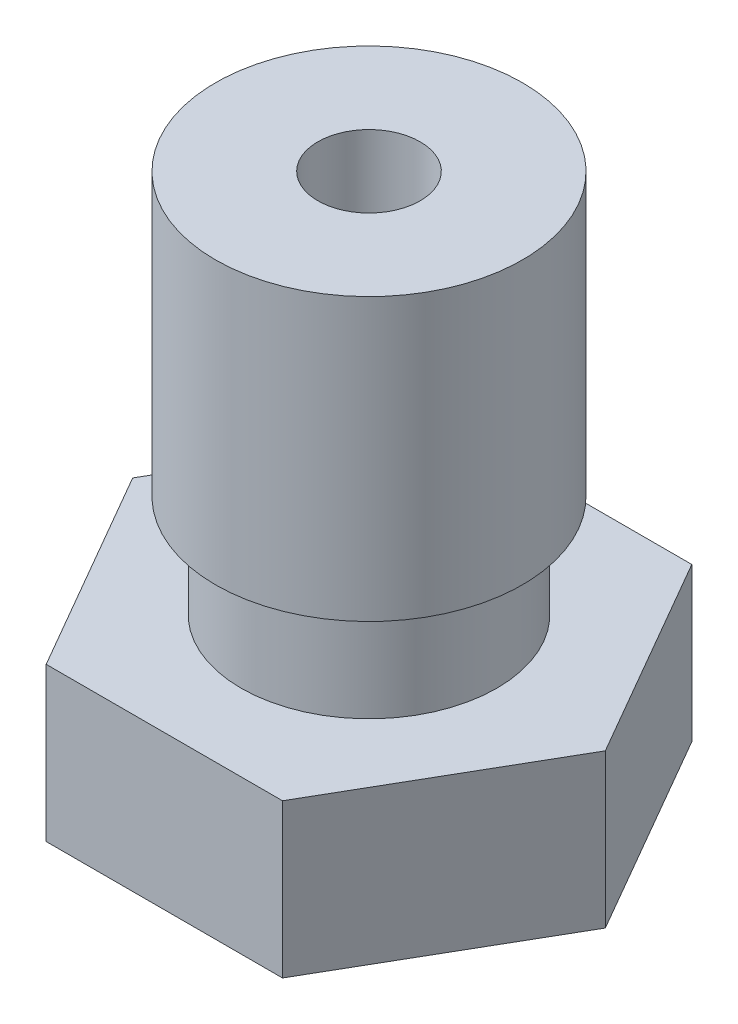
ISO-10303-21;
HEADER;
FILE_DESCRIPTION(('STEP AP214'),'2;1');
FILE_NAME('part.step','',(''),(''),'','','');
FILE_SCHEMA(('AUTOMOTIVE_DESIGN { 1 0 10303 214 1 1 1 1 }'));
ENDSEC;
DATA;
#1=APPLICATION_CONTEXT('core data for automotive mechanical design processes');
#2=APPLICATION_PROTOCOL_DEFINITION('international standard','automotive_design',2000,#1);
#3=PRODUCT_CONTEXT('',#1,'mechanical');
#4=PRODUCT('Part','Part','',(#3));
#5=PRODUCT_RELATED_PRODUCT_CATEGORY('part','',(#4));
#6=PRODUCT_DEFINITION_FORMATION('','',#4);
#7=PRODUCT_DEFINITION_CONTEXT('part definition',#1,'design');
#8=PRODUCT_DEFINITION('design','',#6,#7);
#9=PRODUCT_DEFINITION_SHAPE('','',#8);
#10=(LENGTH_UNIT() NAMED_UNIT(*) SI_UNIT(.MILLI.,.METRE.));
#11=(NAMED_UNIT(*) PLANE_ANGLE_UNIT() SI_UNIT($,.RADIAN.));
#12=(NAMED_UNIT(*) SI_UNIT($,.STERADIAN.) SOLID_ANGLE_UNIT());
#13=UNCERTAINTY_MEASURE_WITH_UNIT(LENGTH_MEASURE(1.E-05),#10,'distance_accuracy_value','');
#14=(GEOMETRIC_REPRESENTATION_CONTEXT(3) GLOBAL_UNCERTAINTY_ASSIGNED_CONTEXT((#13)) GLOBAL_UNIT_ASSIGNED_CONTEXT((#10,
#11,#12)) REPRESENTATION_CONTEXT('',''));
#15=CARTESIAN_POINT('',(0.,0.,0.));
#16=DIRECTION('',(0.,0.,1.));
#17=DIRECTION('',(1.,0.,0.));
#18=AXIS2_PLACEMENT_3D('',#15,#16,#17);
#19=CARTESIAN_POINT('',(0.,3.,0.));
#20=DIRECTION('',(0.,1.,0.));
#21=DIRECTION('',(0.,0.,1.));
#22=AXIS2_PLACEMENT_3D('',#19,#20,#21);
#23=PLANE('',#22);
#24=DIRECTION('',(-0.5,0.,-0.866025403784439));
#25=VECTOR('',#24,1.);
#26=CARTESIAN_POINT('',(4.61880215351701,3.,0.));
#27=LINE('',#26,#25);
#28=CARTESIAN_POINT('',(4.61880215351701,3.,0.));
#29=VERTEX_POINT('',#28);
#30=CARTESIAN_POINT('',(2.3094010767585,3.,-4.00000000000001));
#31=VERTEX_POINT('',#30);
#32=EDGE_CURVE('E131',#29,#31,#27,.T.);
#33=ORIENTED_EDGE('',*,*,#32,.T.);
#34=DIRECTION('',(-1.,0.,0.));
#35=VECTOR('',#34,1.);
#36=CARTESIAN_POINT('',(2.3094010767585,3.,-4.00000000000001));
#37=LINE('',#36,#35);
#38=CARTESIAN_POINT('',(-2.30940107675849,3.,-4.));
#39=VERTEX_POINT('',#38);
#40=EDGE_CURVE('E89',#31,#39,#37,.T.);
#41=ORIENTED_EDGE('',*,*,#40,.T.);
#42=DIRECTION('',(-0.5,0.,0.866025403784439));
#43=VECTOR('',#42,1.);
#44=CARTESIAN_POINT('',(-2.30940107675849,3.,-4.));
#45=LINE('',#44,#43);
#46=CARTESIAN_POINT('',(-4.618802153517,3.,0.));
#47=VERTEX_POINT('',#46);
#48=EDGE_CURVE('E102',#39,#47,#45,.T.);
#49=ORIENTED_EDGE('',*,*,#48,.T.);
#50=DIRECTION('',(0.5,0.,0.866025403784438));
#51=VECTOR('',#50,1.);
#52=CARTESIAN_POINT('',(-4.618802153517,3.,0.));
#53=LINE('',#52,#51);
#54=CARTESIAN_POINT('',(-2.3094010767585,3.,4.));
#55=VERTEX_POINT('',#54);
#56=EDGE_CURVE('E96',#47,#55,#53,.T.);
#57=ORIENTED_EDGE('',*,*,#56,.T.);
#58=DIRECTION('',(1.,0.,0.));
#59=VECTOR('',#58,1.);
#60=CARTESIAN_POINT('',(-2.3094010767585,3.,4.));
#61=LINE('',#60,#59);
#62=CARTESIAN_POINT('',(2.3094010767585,3.,4.));
#63=VERTEX_POINT('',#62);
#64=EDGE_CURVE('E100',#55,#63,#61,.T.);
#65=ORIENTED_EDGE('',*,*,#64,.T.);
#66=DIRECTION('',(0.5,0.,-0.866025403784439));
#67=VECTOR('',#66,1.);
#68=CARTESIAN_POINT('',(2.3094010767585,3.,4.));
#69=LINE('',#68,#67);
#70=EDGE_CURVE('E52',#63,#29,#69,.T.);
#71=ORIENTED_EDGE('',*,*,#70,.T.);
#72=EDGE_LOOP('',(#33,#41,#49,#57,#65,#71));
#73=FACE_BOUND('',#72,.T.);
#74=CARTESIAN_POINT('',(0.,3.,0.));
#75=DIRECTION('',(0.,-1.,0.));
#76=DIRECTION('',(0.,0.,-1.));
#77=AXIS2_PLACEMENT_3D('',#74,#75,#76);
#78=CIRCLE('',#77,2.5);
#79=CARTESIAN_POINT('',(0.,3.,-2.5));
#80=VERTEX_POINT('',#79);
#81=EDGE_CURVE('E217',#80,#80,#78,.T.);
#82=ORIENTED_EDGE('',*,*,#81,.T.);
#83=EDGE_LOOP('',(#82));
#84=FACE_BOUND('',#83,.T.);
#85=ADVANCED_FACE('F35',(#73,#84),#23,.T.);
#86=CARTESIAN_POINT('',(0.,0.,0.));
#87=DIRECTION('',(0.,1.,0.));
#88=DIRECTION('',(0.,0.,1.));
#89=AXIS2_PLACEMENT_3D('',#86,#87,#88);
#90=PLANE('',#89);
#91=CARTESIAN_POINT('',(0.,0.,0.));
#92=DIRECTION('',(0.,-1.,0.));
#93=DIRECTION('',(0.,0.,-1.));
#94=AXIS2_PLACEMENT_3D('',#91,#92,#93);
#95=CIRCLE('',#94,2.00041507641941);
#96=CARTESIAN_POINT('',(0.,0.,-2.00041507641941));
#97=VERTEX_POINT('',#96);
#98=EDGE_CURVE('E195',#97,#97,#95,.T.);
#99=ORIENTED_EDGE('',*,*,#98,.F.);
#100=EDGE_LOOP('',(#99));
#101=FACE_BOUND('',#100,.T.);
#102=DIRECTION('',(-0.5,0.,-0.866025403784439));
#103=VECTOR('',#102,1.);
#104=CARTESIAN_POINT('',(4.61880215351701,0.,0.));
#105=LINE('',#104,#103);
#106=CARTESIAN_POINT('',(4.61880215351701,0.,0.));
#107=VERTEX_POINT('',#106);
#108=CARTESIAN_POINT('',(2.3094010767585,0.,-4.00000000000001));
#109=VERTEX_POINT('',#108);
#110=EDGE_CURVE('E120',#107,#109,#105,.T.);
#111=ORIENTED_EDGE('',*,*,#110,.F.);
#112=DIRECTION('',(0.5,0.,-0.866025403784439));
#113=VECTOR('',#112,1.);
#114=CARTESIAN_POINT('',(2.3094010767585,0.,4.));
#115=LINE('',#114,#113);
#116=CARTESIAN_POINT('',(2.3094010767585,0.,4.));
#117=VERTEX_POINT('',#116);
#118=EDGE_CURVE('E81',#117,#107,#115,.T.);
#119=ORIENTED_EDGE('',*,*,#118,.F.);
#120=DIRECTION('',(1.,0.,0.));
#121=VECTOR('',#120,1.);
#122=CARTESIAN_POINT('',(-2.3094010767585,0.,4.));
#123=LINE('',#122,#121);
#124=CARTESIAN_POINT('',(-2.3094010767585,0.,4.));
#125=VERTEX_POINT('',#124);
#126=EDGE_CURVE('E75',#125,#117,#123,.T.);
#127=ORIENTED_EDGE('',*,*,#126,.F.);
#128=DIRECTION('',(0.5,0.,0.866025403784438));
#129=VECTOR('',#128,1.);
#130=CARTESIAN_POINT('',(-4.618802153517,0.,0.));
#131=LINE('',#130,#129);
#132=CARTESIAN_POINT('',(-4.618802153517,0.,0.));
#133=VERTEX_POINT('',#132);
#134=EDGE_CURVE('E110',#133,#125,#131,.T.);
#135=ORIENTED_EDGE('',*,*,#134,.F.);
#136=DIRECTION('',(-0.5,0.,0.866025403784439));
#137=VECTOR('',#136,1.);
#138=CARTESIAN_POINT('',(-2.30940107675849,0.,-4.));
#139=LINE('',#138,#137);
#140=CARTESIAN_POINT('',(-2.30940107675849,0.,-4.));
#141=VERTEX_POINT('',#140);
#142=EDGE_CURVE('E126',#141,#133,#139,.T.);
#143=ORIENTED_EDGE('',*,*,#142,.F.);
#144=DIRECTION('',(-1.,0.,0.));
#145=VECTOR('',#144,1.);
#146=CARTESIAN_POINT('',(2.3094010767585,0.,-4.00000000000001));
#147=LINE('',#146,#145);
#148=EDGE_CURVE('E123',#109,#141,#147,.T.);
#149=ORIENTED_EDGE('',*,*,#148,.F.);
#150=EDGE_LOOP('',(#111,#119,#127,#135,#143,#149));
#151=FACE_BOUND('',#150,.T.);
#152=ADVANCED_FACE('F140',(#101,#151),#90,.F.);
#153=CARTESIAN_POINT('',(4.61880215351701,3.,0.));
#154=DIRECTION('',(-0.866025403784439,0.,0.5));
#155=DIRECTION('',(0.5,0.,0.866025403784439));
#156=AXIS2_PLACEMENT_3D('',#153,#154,#155);
#157=PLANE('',#156);
#158=ORIENTED_EDGE('',*,*,#110,.T.);
#159=DIRECTION('',(0.,-1.,0.));
#160=VECTOR('',#159,1.);
#161=CARTESIAN_POINT('',(2.3094010767585,3.,-4.00000000000001));
#162=LINE('',#161,#160);
#163=EDGE_CURVE('E11',#31,#109,#162,.T.);
#164=ORIENTED_EDGE('',*,*,#163,.F.);
#165=ORIENTED_EDGE('',*,*,#32,.F.);
#166=DIRECTION('',(0.,-1.,0.));
#167=VECTOR('',#166,1.);
#168=CARTESIAN_POINT('',(4.61880215351701,3.,0.));
#169=LINE('',#168,#167);
#170=EDGE_CURVE('E116',#29,#107,#169,.T.);
#171=ORIENTED_EDGE('',*,*,#170,.T.);
#172=EDGE_LOOP('',(#158,#164,#165,#171));
#173=FACE_BOUND('',#172,.T.);
#174=ADVANCED_FACE('F37',(#173),#157,.F.);
#175=CARTESIAN_POINT('',(2.3094010767585,3.,-4.00000000000001));
#176=DIRECTION('',(0.,0.,1.));
#177=DIRECTION('',(1.,0.,0.));
#178=AXIS2_PLACEMENT_3D('',#175,#176,#177);
#179=PLANE('',#178);
#180=ORIENTED_EDGE('',*,*,#148,.T.);
#181=DIRECTION('',(0.,-1.,0.));
#182=VECTOR('',#181,1.);
#183=CARTESIAN_POINT('',(-2.30940107675849,3.,-4.));
#184=LINE('',#183,#182);
#185=EDGE_CURVE('E44',#39,#141,#184,.T.);
#186=ORIENTED_EDGE('',*,*,#185,.F.);
#187=ORIENTED_EDGE('',*,*,#40,.F.);
#188=ORIENTED_EDGE('',*,*,#163,.T.);
#189=EDGE_LOOP('',(#180,#186,#187,#188));
#190=FACE_BOUND('',#189,.T.);
#191=ADVANCED_FACE('F305',(#190),#179,.F.);
#192=CARTESIAN_POINT('',(-2.30940107675849,3.,-4.));
#193=DIRECTION('',(0.866025403784439,0.,0.5));
#194=DIRECTION('',(0.5,0.,-0.866025403784439));
#195=AXIS2_PLACEMENT_3D('',#192,#193,#194);
#196=PLANE('',#195);
#197=ORIENTED_EDGE('',*,*,#142,.T.);
#198=DIRECTION('',(0.,-1.,0.));
#199=VECTOR('',#198,1.);
#200=CARTESIAN_POINT('',(-4.618802153517,3.,0.));
#201=LINE('',#200,#199);
#202=EDGE_CURVE('E111',#47,#133,#201,.T.);
#203=ORIENTED_EDGE('',*,*,#202,.F.);
#204=ORIENTED_EDGE('',*,*,#48,.F.);
#205=ORIENTED_EDGE('',*,*,#185,.T.);
#206=EDGE_LOOP('',(#197,#203,#204,#205));
#207=FACE_BOUND('',#206,.T.);
#208=ADVANCED_FACE('F137',(#207),#196,.F.);
#209=CARTESIAN_POINT('',(-4.618802153517,3.,0.));
#210=DIRECTION('',(0.866025403784439,0.,-0.5));
#211=DIRECTION('',(-0.5,0.,-0.866025403784439));
#212=AXIS2_PLACEMENT_3D('',#209,#210,#211);
#213=PLANE('',#212);
#214=ORIENTED_EDGE('',*,*,#134,.T.);
#215=DIRECTION('',(0.,-1.,0.));
#216=VECTOR('',#215,1.);
#217=CARTESIAN_POINT('',(-2.3094010767585,3.,4.));
#218=LINE('',#217,#216);
#219=EDGE_CURVE('E107',#55,#125,#218,.T.);
#220=ORIENTED_EDGE('',*,*,#219,.F.);
#221=ORIENTED_EDGE('',*,*,#56,.F.);
#222=ORIENTED_EDGE('',*,*,#202,.T.);
#223=EDGE_LOOP('',(#214,#220,#221,#222));
#224=FACE_BOUND('',#223,.T.);
#225=ADVANCED_FACE('F108',(#224),#213,.F.);
#226=CARTESIAN_POINT('',(-2.3094010767585,3.,4.));
#227=DIRECTION('',(0.,0.,-1.));
#228=DIRECTION('',(-1.,0.,0.));
#229=AXIS2_PLACEMENT_3D('',#226,#227,#228);
#230=PLANE('',#229);
#231=ORIENTED_EDGE('',*,*,#126,.T.);
#232=DIRECTION('',(0.,-1.,0.));
#233=VECTOR('',#232,1.);
#234=CARTESIAN_POINT('',(2.3094010767585,3.,4.));
#235=LINE('',#234,#233);
#236=EDGE_CURVE('E112',#63,#117,#235,.T.);
#237=ORIENTED_EDGE('',*,*,#236,.F.);
#238=ORIENTED_EDGE('',*,*,#64,.F.);
#239=ORIENTED_EDGE('',*,*,#219,.T.);
#240=EDGE_LOOP('',(#231,#237,#238,#239));
#241=FACE_BOUND('',#240,.T.);
#242=ADVANCED_FACE('F114',(#241),#230,.F.);
#243=CARTESIAN_POINT('',(2.3094010767585,3.,4.));
#244=DIRECTION('',(-0.866025403784439,0.,-0.5));
#245=DIRECTION('',(-0.5,0.,0.866025403784439));
#246=AXIS2_PLACEMENT_3D('',#243,#244,#245);
#247=PLANE('',#246);
#248=ORIENTED_EDGE('',*,*,#118,.T.);
#249=ORIENTED_EDGE('',*,*,#170,.F.);
#250=ORIENTED_EDGE('',*,*,#70,.F.);
#251=ORIENTED_EDGE('',*,*,#236,.T.);
#252=EDGE_LOOP('',(#248,#249,#250,#251));
#253=FACE_BOUND('',#252,.T.);
#254=ADVANCED_FACE('F144',(#253),#247,.F.);
#255=CARTESIAN_POINT('',(0.,3.,0.));
#256=DIRECTION('',(0.,-1.,0.));
#257=DIRECTION('',(0.,0.,-1.));
#258=AXIS2_PLACEMENT_3D('',#255,#256,#257);
#259=CYLINDRICAL_SURFACE('',#258,1.);
#260=CARTESIAN_POINT('',(0.,0.,0.));
#261=DIRECTION('',(0.,1.,0.));
#262=DIRECTION('',(0.,0.,1.));
#263=AXIS2_PLACEMENT_3D('',#260,#261,#262);
#264=CIRCLE('',#263,1.);
#265=CARTESIAN_POINT('',(0.,0.,1.));
#266=VERTEX_POINT('',#265);
#267=EDGE_CURVE('E124',#266,#266,#264,.T.);
#268=ORIENTED_EDGE('',*,*,#267,.F.);
#269=EDGE_LOOP('',(#268));
#270=FACE_BOUND('',#269,.T.);
#271=CARTESIAN_POINT('',(0.,10.5,0.));
#272=DIRECTION('',(0.,-1.,0.));
#273=DIRECTION('',(0.,0.,-1.));
#274=AXIS2_PLACEMENT_3D('',#271,#272,#273);
#275=CIRCLE('',#274,1.);
#276=CARTESIAN_POINT('',(0.,10.5,-1.));
#277=VERTEX_POINT('',#276);
#278=EDGE_CURVE('E202',#277,#277,#275,.T.);
#279=ORIENTED_EDGE('',*,*,#278,.F.);
#280=EDGE_LOOP('',(#279));
#281=FACE_BOUND('',#280,.T.);
#282=ADVANCED_FACE('F146',(#270,#281),#259,.F.);
#283=CARTESIAN_POINT('',(0.,-2.,0.));
#284=DIRECTION('',(0.,-1.,0.));
#285=DIRECTION('',(0.,0.,-1.));
#286=AXIS2_PLACEMENT_3D('',#283,#284,#285);
#287=CYLINDRICAL_SURFACE('',#286,2.5);
#288=ORIENTED_EDGE('',*,*,#81,.F.);
#289=EDGE_LOOP('',(#288));
#290=FACE_BOUND('',#289,.T.);
#291=CARTESIAN_POINT('',(0.,5.,0.));
#292=DIRECTION('',(0.,-1.,0.));
#293=DIRECTION('',(0.,0.,-1.));
#294=AXIS2_PLACEMENT_3D('',#291,#292,#293);
#295=CIRCLE('',#294,2.5);
#296=CARTESIAN_POINT('',(0.,5.,-2.5));
#297=VERTEX_POINT('',#296);
#298=EDGE_CURVE('E214',#297,#297,#295,.T.);
#299=ORIENTED_EDGE('',*,*,#298,.T.);
#300=EDGE_LOOP('',(#299));
#301=FACE_BOUND('',#300,.T.);
#302=ADVANCED_FACE('F152',(#290,#301),#287,.T.);
#303=CARTESIAN_POINT('',(0.,5.,0.));
#304=DIRECTION('',(0.,1.,0.));
#305=DIRECTION('',(0.,0.,1.));
#306=AXIS2_PLACEMENT_3D('',#303,#304,#305);
#307=PLANE('',#306);
#308=ORIENTED_EDGE('',*,*,#298,.F.);
#309=EDGE_LOOP('',(#308));
#310=FACE_BOUND('',#309,.T.);
#311=CARTESIAN_POINT('',(0.,5.,0.));
#312=DIRECTION('',(0.,-1.,0.));
#313=DIRECTION('',(0.,0.,-1.));
#314=AXIS2_PLACEMENT_3D('',#311,#312,#313);
#315=CIRCLE('',#314,3.);
#316=CARTESIAN_POINT('',(0.,5.,-3.));
#317=VERTEX_POINT('',#316);
#318=EDGE_CURVE('E211',#317,#317,#315,.T.);
#319=ORIENTED_EDGE('',*,*,#318,.T.);
#320=EDGE_LOOP('',(#319));
#321=FACE_BOUND('',#320,.T.);
#322=ADVANCED_FACE('F166',(#310,#321),#307,.F.);
#323=CARTESIAN_POINT('',(0.,-2.,0.));
#324=DIRECTION('',(0.,-1.,0.));
#325=DIRECTION('',(0.,0.,-1.));
#326=AXIS2_PLACEMENT_3D('',#323,#324,#325);
#327=CYLINDRICAL_SURFACE('',#326,3.);
#328=ORIENTED_EDGE('',*,*,#318,.F.);
#329=EDGE_LOOP('',(#328));
#330=FACE_BOUND('',#329,.T.);
#331=CARTESIAN_POINT('',(0.,10.5,0.));
#332=DIRECTION('',(0.,-1.,0.));
#333=DIRECTION('',(0.,0.,-1.));
#334=AXIS2_PLACEMENT_3D('',#331,#332,#333);
#335=CIRCLE('',#334,3.);
#336=CARTESIAN_POINT('',(0.,10.5,-3.));
#337=VERTEX_POINT('',#336);
#338=EDGE_CURVE('E208',#337,#337,#335,.T.);
#339=ORIENTED_EDGE('',*,*,#338,.T.);
#340=EDGE_LOOP('',(#339));
#341=FACE_BOUND('',#340,.T.);
#342=ADVANCED_FACE('F170',(#330,#341),#327,.T.);
#343=CARTESIAN_POINT('',(0.,10.5,0.));
#344=DIRECTION('',(0.,-1.,0.));
#345=DIRECTION('',(0.,0.,-1.));
#346=AXIS2_PLACEMENT_3D('',#343,#344,#345);
#347=PLANE('',#346);
#348=ORIENTED_EDGE('',*,*,#338,.F.);
#349=EDGE_LOOP('',(#348));
#350=FACE_BOUND('',#349,.T.);
#351=ORIENTED_EDGE('',*,*,#278,.T.);
#352=EDGE_LOOP('',(#351));
#353=FACE_BOUND('',#352,.T.);
#354=ADVANCED_FACE('F174',(#350,#353),#347,.F.);
#355=CARTESIAN_POINT('',(0.,0.,0.));
#356=DIRECTION('',(0.,1.,0.));
#357=DIRECTION('',(0.,0.,1.));
#358=AXIS2_PLACEMENT_3D('',#355,#356,#357);
#359=CONICAL_SURFACE('',#358,1.,0.369684288795301);
#360=CARTESIAN_POINT('',(0.,-2.,0.));
#361=DIRECTION('',(0.,-1.,0.));
#362=DIRECTION('',(0.,0.,-1.));
#363=AXIS2_PLACEMENT_3D('',#360,#361,#362);
#364=CIRCLE('',#363,0.225);
#365=CARTESIAN_POINT('',(0.,-2.,-0.225));
#366=VERTEX_POINT('',#365);
#367=EDGE_CURVE('E199',#366,#366,#364,.T.);
#368=ORIENTED_EDGE('',*,*,#367,.T.);
#369=EDGE_LOOP('',(#368));
#370=FACE_BOUND('',#369,.T.);
#371=ORIENTED_EDGE('',*,*,#267,.T.);
#372=EDGE_LOOP('',(#371));
#373=FACE_BOUND('',#372,.T.);
#374=ADVANCED_FACE('F178',(#370,#373),#359,.F.);
#375=CARTESIAN_POINT('',(0.,-2.,0.));
#376=DIRECTION('',(0.,-1.,0.));
#377=DIRECTION('',(0.,0.,-1.));
#378=AXIS2_PLACEMENT_3D('',#375,#376,#377);
#379=PLANE('',#378);
#380=CARTESIAN_POINT('',(0.,-2.,0.));
#381=DIRECTION('',(0.,-1.,0.));
#382=DIRECTION('',(0.,0.,-1.));
#383=AXIS2_PLACEMENT_3D('',#380,#381,#382);
#384=CIRCLE('',#383,0.6);
#385=CARTESIAN_POINT('',(0.,-2.,-0.6));
#386=VERTEX_POINT('',#385);
#387=EDGE_CURVE('E198',#386,#386,#384,.T.);
#388=ORIENTED_EDGE('',*,*,#387,.T.);
#389=EDGE_LOOP('',(#388));
#390=FACE_BOUND('',#389,.T.);
#391=ORIENTED_EDGE('',*,*,#367,.F.);
#392=EDGE_LOOP('',(#391));
#393=FACE_BOUND('',#392,.T.);
#394=ADVANCED_FACE('F182',(#390,#393),#379,.T.);
#395=CARTESIAN_POINT('',(0.,-2.,0.));
#396=DIRECTION('',(0.,1.,0.));
#397=DIRECTION('',(0.,0.,1.));
#398=AXIS2_PLACEMENT_3D('',#395,#396,#397);
#399=CONICAL_SURFACE('',#398,0.6,0.610865238198013);
#400=ORIENTED_EDGE('',*,*,#98,.T.);
#401=EDGE_LOOP('',(#400));
#402=FACE_BOUND('',#401,.T.);
#403=ORIENTED_EDGE('',*,*,#387,.F.);
#404=EDGE_LOOP('',(#403));
#405=FACE_BOUND('',#404,.T.);
#406=ADVANCED_FACE('F186',(#402,#405),#399,.T.);
#407=CLOSED_SHELL('',(#85,#152,#174,#191,#208,#225,#242,#254,#282,#302,#322,#342,#354,#374,#394,#406));
#408=MANIFOLD_SOLID_BREP('B2',#407);
#409=ADVANCED_BREP_SHAPE_REPRESENTATION('',(#18,#408),#14);
#410=SHAPE_DEFINITION_REPRESENTATION(#9,#409);
ENDSEC;
END-ISO-10303-21;
